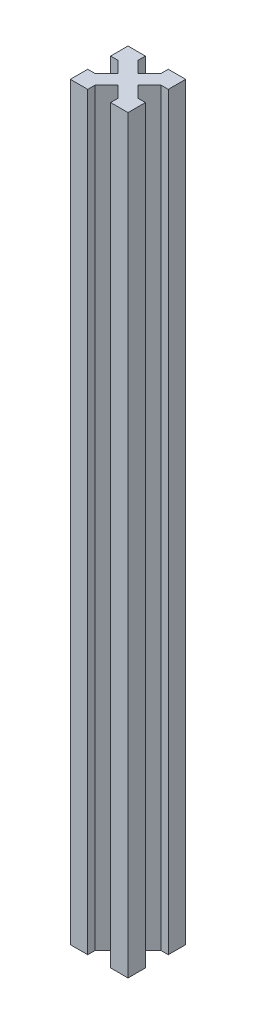
ISO-10303-21;
HEADER;
FILE_DESCRIPTION(('STEP AP214'),'2;1');
FILE_NAME('part.step','',(''),(''),'','','');
FILE_SCHEMA(('AUTOMOTIVE_DESIGN { 1 0 10303 214 1 1 1 1 }'));
ENDSEC;
DATA;
#1=APPLICATION_CONTEXT('core data for automotive mechanical design processes');
#2=APPLICATION_PROTOCOL_DEFINITION('international standard','automotive_design',2000,#1);
#3=PRODUCT_CONTEXT('',#1,'mechanical');
#4=PRODUCT('Part','Part','',(#3));
#5=PRODUCT_RELATED_PRODUCT_CATEGORY('part','',(#4));
#6=PRODUCT_DEFINITION_FORMATION('','',#4);
#7=PRODUCT_DEFINITION_CONTEXT('part definition',#1,'design');
#8=PRODUCT_DEFINITION('design','',#6,#7);
#9=PRODUCT_DEFINITION_SHAPE('','',#8);
#10=(LENGTH_UNIT() NAMED_UNIT(*) SI_UNIT(.MILLI.,.METRE.));
#11=(NAMED_UNIT(*) PLANE_ANGLE_UNIT() SI_UNIT($,.RADIAN.));
#12=(NAMED_UNIT(*) SI_UNIT($,.STERADIAN.) SOLID_ANGLE_UNIT());
#13=UNCERTAINTY_MEASURE_WITH_UNIT(LENGTH_MEASURE(1.E-05),#10,'distance_accuracy_value','');
#14=(GEOMETRIC_REPRESENTATION_CONTEXT(3) GLOBAL_UNCERTAINTY_ASSIGNED_CONTEXT((#13)) GLOBAL_UNIT_ASSIGNED_CONTEXT((#10,
#11,#12)) REPRESENTATION_CONTEXT('',''));
#15=CARTESIAN_POINT('',(0.,0.,0.));
#16=DIRECTION('',(0.,0.,1.));
#17=DIRECTION('',(1.,0.,0.));
#18=AXIS2_PLACEMENT_3D('',#15,#16,#17);
#19=CARTESIAN_POINT('',(-11.7677669529664,260.,-11.7677669529664));
#20=DIRECTION('',(0.707106781186548,0.,0.707106781186547));
#21=DIRECTION('',(0.707106781186547,0.,-0.707106781186548));
#22=AXIS2_PLACEMENT_3D('',#19,#20,#21);
#23=PLANE('',#22);
#24=DIRECTION('',(-0.707106781186547,0.,0.707106781186548));
#25=VECTOR('',#24,1.);
#26=CARTESIAN_POINT('',(-11.7677669529664,0.,-11.7677669529664));
#27=LINE('',#26,#25);
#28=CARTESIAN_POINT('',(-13.5355339059327,0.,-10.));
#29=VERTEX_POINT('',#28);
#30=CARTESIAN_POINT('',(-17.5,0.,-6.03553390593274));
#31=VERTEX_POINT('',#30);
#32=EDGE_CURVE('E231',#29,#31,#27,.T.);
#33=ORIENTED_EDGE('',*,*,#32,.T.);
#34=DIRECTION('',(0.,-1.,0.));
#35=VECTOR('',#34,1.);
#36=CARTESIAN_POINT('',(-17.5,260.,-6.03553390593274));
#37=LINE('',#36,#35);
#38=CARTESIAN_POINT('',(-17.5,260.,-6.03553390593274));
#39=VERTEX_POINT('',#38);
#40=EDGE_CURVE('E11',#39,#31,#37,.T.);
#41=ORIENTED_EDGE('',*,*,#40,.F.);
#42=DIRECTION('',(-0.707106781186547,0.,0.707106781186548));
#43=VECTOR('',#42,1.);
#44=CARTESIAN_POINT('',(-11.7677669529664,260.,-11.7677669529664));
#45=LINE('',#44,#43);
#46=CARTESIAN_POINT('',(-13.5355339059327,260.,-10.));
#47=VERTEX_POINT('',#46);
#48=EDGE_CURVE('E294',#47,#39,#45,.T.);
#49=ORIENTED_EDGE('',*,*,#48,.F.);
#50=DIRECTION('',(0.,-1.,0.));
#51=VECTOR('',#50,1.);
#52=CARTESIAN_POINT('',(-13.5355339059327,260.,-10.));
#53=LINE('',#52,#51);
#54=EDGE_CURVE('E227',#47,#29,#53,.T.);
#55=ORIENTED_EDGE('',*,*,#54,.T.);
#56=EDGE_LOOP('',(#33,#41,#49,#55));
#57=FACE_BOUND('',#56,.T.);
#58=ADVANCED_FACE('F41',(#57),#23,.F.);
#59=CARTESIAN_POINT('',(0.,260.,-6.03553390593274));
#60=DIRECTION('',(0.,0.,1.));
#61=DIRECTION('',(1.,0.,0.));
#62=AXIS2_PLACEMENT_3D('',#59,#60,#61);
#63=PLANE('',#62);
#64=DIRECTION('',(-1.,0.,0.));
#65=VECTOR('',#64,1.);
#66=CARTESIAN_POINT('',(0.,0.,-6.03553390593274));
#67=LINE('',#66,#65);
#68=CARTESIAN_POINT('',(-20.,0.,-6.03553390593274));
#69=VERTEX_POINT('',#68);
#70=EDGE_CURVE('E234',#31,#69,#67,.T.);
#71=ORIENTED_EDGE('',*,*,#70,.T.);
#72=DIRECTION('',(0.,-1.,0.));
#73=VECTOR('',#72,1.);
#74=CARTESIAN_POINT('',(-20.,260.,-6.03553390593274));
#75=LINE('',#74,#73);
#76=CARTESIAN_POINT('',(-20.,260.,-6.03553390593274));
#77=VERTEX_POINT('',#76);
#78=EDGE_CURVE('E49',#77,#69,#75,.T.);
#79=ORIENTED_EDGE('',*,*,#78,.F.);
#80=DIRECTION('',(-1.,0.,0.));
#81=VECTOR('',#80,1.);
#82=CARTESIAN_POINT('',(0.,260.,-6.03553390593274));
#83=LINE('',#82,#81);
#84=EDGE_CURVE('E144',#39,#77,#83,.T.);
#85=ORIENTED_EDGE('',*,*,#84,.F.);
#86=ORIENTED_EDGE('',*,*,#40,.T.);
#87=EDGE_LOOP('',(#71,#79,#85,#86));
#88=FACE_BOUND('',#87,.T.);
#89=ADVANCED_FACE('F343',(#88),#63,.F.);
#90=CARTESIAN_POINT('',(-20.,260.,0.));
#91=DIRECTION('',(-1.,0.,0.));
#92=DIRECTION('',(0.,0.,1.));
#93=AXIS2_PLACEMENT_3D('',#90,#91,#92);
#94=PLANE('',#93);
#95=DIRECTION('',(0.,0.,-1.));
#96=VECTOR('',#95,1.);
#97=CARTESIAN_POINT('',(-20.,0.,0.));
#98=LINE('',#97,#96);
#99=CARTESIAN_POINT('',(-20.,0.,0.));
#100=VERTEX_POINT('',#99);
#101=EDGE_CURVE('E237',#100,#69,#98,.T.);
#102=ORIENTED_EDGE('',*,*,#101,.F.);
#103=DIRECTION('',(0.,-1.,0.));
#104=VECTOR('',#103,1.);
#105=CARTESIAN_POINT('',(-20.,260.,0.));
#106=LINE('',#105,#104);
#107=CARTESIAN_POINT('',(-20.,260.,0.));
#108=VERTEX_POINT('',#107);
#109=EDGE_CURVE('E336',#108,#100,#106,.T.);
#110=ORIENTED_EDGE('',*,*,#109,.F.);
#111=DIRECTION('',(0.,0.,-1.));
#112=VECTOR('',#111,1.);
#113=CARTESIAN_POINT('',(-20.,260.,0.));
#114=LINE('',#113,#112);
#115=EDGE_CURVE('E342',#108,#77,#114,.T.);
#116=ORIENTED_EDGE('',*,*,#115,.T.);
#117=ORIENTED_EDGE('',*,*,#78,.T.);
#118=EDGE_LOOP('',(#102,#110,#116,#117));
#119=FACE_BOUND('',#118,.T.);
#120=ADVANCED_FACE('F340',(#119),#94,.T.);
#121=CARTESIAN_POINT('',(0.,260.,0.));
#122=DIRECTION('',(0.,0.,1.));
#123=DIRECTION('',(1.,0.,0.));
#124=AXIS2_PLACEMENT_3D('',#121,#122,#123);
#125=PLANE('',#124);
#126=DIRECTION('',(-1.,0.,0.));
#127=VECTOR('',#126,1.);
#128=CARTESIAN_POINT('',(0.,0.,0.));
#129=LINE('',#128,#127);
#130=CARTESIAN_POINT('',(-13.9644660940673,0.,0.));
#131=VERTEX_POINT('',#130);
#132=EDGE_CURVE('E240',#131,#100,#129,.T.);
#133=ORIENTED_EDGE('',*,*,#132,.F.);
#134=DIRECTION('',(0.,-1.,0.));
#135=VECTOR('',#134,1.);
#136=CARTESIAN_POINT('',(-13.9644660940673,260.,0.));
#137=LINE('',#136,#135);
#138=CARTESIAN_POINT('',(-13.9644660940673,260.,0.));
#139=VERTEX_POINT('',#138);
#140=EDGE_CURVE('E334',#139,#131,#137,.T.);
#141=ORIENTED_EDGE('',*,*,#140,.F.);
#142=DIRECTION('',(-1.,0.,0.));
#143=VECTOR('',#142,1.);
#144=CARTESIAN_POINT('',(0.,260.,0.));
#145=LINE('',#144,#143);
#146=EDGE_CURVE('E354',#139,#108,#145,.T.);
#147=ORIENTED_EDGE('',*,*,#146,.T.);
#148=ORIENTED_EDGE('',*,*,#109,.T.);
#149=EDGE_LOOP('',(#133,#141,#147,#148));
#150=FACE_BOUND('',#149,.T.);
#151=ADVANCED_FACE('F351',(#150),#125,.T.);
#152=CARTESIAN_POINT('',(-13.9644660940673,260.,0.));
#153=DIRECTION('',(1.,0.,0.));
#154=DIRECTION('',(0.,0.,-1.));
#155=AXIS2_PLACEMENT_3D('',#152,#153,#154);
#156=PLANE('',#155);
#157=DIRECTION('',(0.,0.,1.));
#158=VECTOR('',#157,1.);
#159=CARTESIAN_POINT('',(-13.9644660940673,0.,0.));
#160=LINE('',#159,#158);
#161=CARTESIAN_POINT('',(-13.9644660940673,0.,-2.5));
#162=VERTEX_POINT('',#161);
#163=EDGE_CURVE('E243',#162,#131,#160,.T.);
#164=ORIENTED_EDGE('',*,*,#163,.F.);
#165=DIRECTION('',(0.,-1.,0.));
#166=VECTOR('',#165,1.);
#167=CARTESIAN_POINT('',(-13.9644660940673,260.,-2.5));
#168=LINE('',#167,#166);
#169=CARTESIAN_POINT('',(-13.9644660940673,260.,-2.5));
#170=VERTEX_POINT('',#169);
#171=EDGE_CURVE('E332',#170,#162,#168,.T.);
#172=ORIENTED_EDGE('',*,*,#171,.F.);
#173=DIRECTION('',(0.,0.,1.));
#174=VECTOR('',#173,1.);
#175=CARTESIAN_POINT('',(-13.9644660940673,260.,0.));
#176=LINE('',#175,#174);
#177=EDGE_CURVE('E358',#170,#139,#176,.T.);
#178=ORIENTED_EDGE('',*,*,#177,.T.);
#179=ORIENTED_EDGE('',*,*,#140,.T.);
#180=EDGE_LOOP('',(#164,#172,#178,#179));
#181=FACE_BOUND('',#180,.T.);
#182=ADVANCED_FACE('F432',(#181),#156,.T.);
#183=CARTESIAN_POINT('',(-8.23223304703363,260.,-8.23223304703363));
#184=DIRECTION('',(0.707106781186548,0.,0.707106781186547));
#185=DIRECTION('',(0.707106781186547,0.,-0.707106781186548));
#186=AXIS2_PLACEMENT_3D('',#183,#184,#185);
#187=PLANE('',#186);
#188=DIRECTION('',(-0.707106781186547,0.,0.707106781186548));
#189=VECTOR('',#188,1.);
#190=CARTESIAN_POINT('',(-8.23223304703363,0.,-8.23223304703363));
#191=LINE('',#190,#189);
#192=CARTESIAN_POINT('',(-10.,0.,-6.46446609406726));
#193=VERTEX_POINT('',#192);
#194=EDGE_CURVE('E246',#193,#162,#191,.T.);
#195=ORIENTED_EDGE('',*,*,#194,.F.);
#196=DIRECTION('',(0.,-1.,0.));
#197=VECTOR('',#196,1.);
#198=CARTESIAN_POINT('',(-10.,260.,-6.46446609406726));
#199=LINE('',#198,#197);
#200=CARTESIAN_POINT('',(-10.,260.,-6.46446609406726));
#201=VERTEX_POINT('',#200);
#202=EDGE_CURVE('E330',#201,#193,#199,.T.);
#203=ORIENTED_EDGE('',*,*,#202,.F.);
#204=DIRECTION('',(-0.707106781186547,0.,0.707106781186548));
#205=VECTOR('',#204,1.);
#206=CARTESIAN_POINT('',(-8.23223304703363,260.,-8.23223304703363));
#207=LINE('',#206,#205);
#208=EDGE_CURVE('E364',#201,#170,#207,.T.);
#209=ORIENTED_EDGE('',*,*,#208,.T.);
#210=ORIENTED_EDGE('',*,*,#171,.T.);
#211=EDGE_LOOP('',(#195,#203,#209,#210));
#212=FACE_BOUND('',#211,.T.);
#213=ADVANCED_FACE('F435',(#212),#187,.T.);
#214=CARTESIAN_POINT('',(-1.76776695296637,260.,1.76776695296637));
#215=DIRECTION('',(0.707106781186548,0.,-0.707106781186548));
#216=DIRECTION('',(-0.707106781186548,0.,-0.707106781186548));
#217=AXIS2_PLACEMENT_3D('',#214,#215,#216);
#218=PLANE('',#217);
#219=DIRECTION('',(0.707106781186548,0.,0.707106781186548));
#220=VECTOR('',#219,1.);
#221=CARTESIAN_POINT('',(-1.76776695296637,0.,1.76776695296637));
#222=LINE('',#221,#220);
#223=CARTESIAN_POINT('',(-6.03553390593274,0.,-2.5));
#224=VERTEX_POINT('',#223);
#225=EDGE_CURVE('E249',#193,#224,#222,.T.);
#226=ORIENTED_EDGE('',*,*,#225,.T.);
#227=DIRECTION('',(0.,-1.,0.));
#228=VECTOR('',#227,1.);
#229=CARTESIAN_POINT('',(-6.03553390593274,260.,-2.5));
#230=LINE('',#229,#228);
#231=CARTESIAN_POINT('',(-6.03553390593274,260.,-2.5));
#232=VERTEX_POINT('',#231);
#233=EDGE_CURVE('E327',#232,#224,#230,.T.);
#234=ORIENTED_EDGE('',*,*,#233,.F.);
#235=DIRECTION('',(0.707106781186548,0.,0.707106781186548));
#236=VECTOR('',#235,1.);
#237=CARTESIAN_POINT('',(-1.76776695296637,260.,1.76776695296637));
#238=LINE('',#237,#236);
#239=EDGE_CURVE('E367',#201,#232,#238,.T.);
#240=ORIENTED_EDGE('',*,*,#239,.F.);
#241=ORIENTED_EDGE('',*,*,#202,.T.);
#242=EDGE_LOOP('',(#226,#234,#240,#241));
#243=FACE_BOUND('',#242,.T.);
#244=ADVANCED_FACE('F439',(#243),#218,.F.);
#245=CARTESIAN_POINT('',(-6.03553390593274,260.,0.));
#246=DIRECTION('',(1.,0.,0.));
#247=DIRECTION('',(0.,0.,-1.));
#248=AXIS2_PLACEMENT_3D('',#245,#246,#247);
#249=PLANE('',#248);
#250=DIRECTION('',(0.,0.,1.));
#251=VECTOR('',#250,1.);
#252=CARTESIAN_POINT('',(-6.03553390593274,0.,0.));
#253=LINE('',#252,#251);
#254=CARTESIAN_POINT('',(-6.03553390593274,0.,0.));
#255=VERTEX_POINT('',#254);
#256=EDGE_CURVE('E251',#224,#255,#253,.T.);
#257=ORIENTED_EDGE('',*,*,#256,.T.);
#258=DIRECTION('',(0.,-1.,0.));
#259=VECTOR('',#258,1.);
#260=CARTESIAN_POINT('',(-6.03553390593274,260.,0.));
#261=LINE('',#260,#259);
#262=CARTESIAN_POINT('',(-6.03553390593274,260.,0.));
#263=VERTEX_POINT('',#262);
#264=EDGE_CURVE('E325',#263,#255,#261,.T.);
#265=ORIENTED_EDGE('',*,*,#264,.F.);
#266=DIRECTION('',(0.,0.,1.));
#267=VECTOR('',#266,1.);
#268=CARTESIAN_POINT('',(-6.03553390593274,260.,0.));
#269=LINE('',#268,#267);
#270=EDGE_CURVE('E369',#232,#263,#269,.T.);
#271=ORIENTED_EDGE('',*,*,#270,.F.);
#272=ORIENTED_EDGE('',*,*,#233,.T.);
#273=EDGE_LOOP('',(#257,#265,#271,#272));
#274=FACE_BOUND('',#273,.T.);
#275=ADVANCED_FACE('F443',(#274),#249,.F.);
#276=CARTESIAN_POINT('',(0.,260.,0.));
#277=DIRECTION('',(0.,0.,1.));
#278=DIRECTION('',(1.,0.,0.));
#279=AXIS2_PLACEMENT_3D('',#276,#277,#278);
#280=PLANE('',#279);
#281=DIRECTION('',(-1.,0.,0.));
#282=VECTOR('',#281,1.);
#283=CARTESIAN_POINT('',(0.,0.,0.));
#284=LINE('',#283,#282);
#285=CARTESIAN_POINT('',(0.,0.,0.));
#286=VERTEX_POINT('',#285);
#287=EDGE_CURVE('E254',#286,#255,#284,.T.);
#288=ORIENTED_EDGE('',*,*,#287,.F.);
#289=DIRECTION('',(0.,-1.,0.));
#290=VECTOR('',#289,1.);
#291=CARTESIAN_POINT('',(0.,260.,0.));
#292=LINE('',#291,#290);
#293=CARTESIAN_POINT('',(0.,260.,0.));
#294=VERTEX_POINT('',#293);
#295=EDGE_CURVE('E323',#294,#286,#292,.T.);
#296=ORIENTED_EDGE('',*,*,#295,.F.);
#297=DIRECTION('',(-1.,0.,0.));
#298=VECTOR('',#297,1.);
#299=CARTESIAN_POINT('',(0.,260.,0.));
#300=LINE('',#299,#298);
#301=EDGE_CURVE('E371',#294,#263,#300,.T.);
#302=ORIENTED_EDGE('',*,*,#301,.T.);
#303=ORIENTED_EDGE('',*,*,#264,.T.);
#304=EDGE_LOOP('',(#288,#296,#302,#303));
#305=FACE_BOUND('',#304,.T.);
#306=ADVANCED_FACE('F447',(#305),#280,.T.);
#307=CARTESIAN_POINT('',(0.,260.,0.));
#308=DIRECTION('',(-1.,0.,0.));
#309=DIRECTION('',(0.,0.,1.));
#310=AXIS2_PLACEMENT_3D('',#307,#308,#309);
#311=PLANE('',#310);
#312=DIRECTION('',(0.,0.,-1.));
#313=VECTOR('',#312,1.);
#314=CARTESIAN_POINT('',(0.,0.,0.));
#315=LINE('',#314,#313);
#316=CARTESIAN_POINT('',(0.,0.,-6.03553390593274));
#317=VERTEX_POINT('',#316);
#318=EDGE_CURVE('E257',#286,#317,#315,.T.);
#319=ORIENTED_EDGE('',*,*,#318,.T.);
#320=DIRECTION('',(0.,-1.,0.));
#321=VECTOR('',#320,1.);
#322=CARTESIAN_POINT('',(0.,260.,-6.03553390593274));
#323=LINE('',#322,#321);
#324=CARTESIAN_POINT('',(0.,260.,-6.03553390593274));
#325=VERTEX_POINT('',#324);
#326=EDGE_CURVE('E321',#325,#317,#323,.T.);
#327=ORIENTED_EDGE('',*,*,#326,.F.);
#328=DIRECTION('',(0.,0.,-1.));
#329=VECTOR('',#328,1.);
#330=CARTESIAN_POINT('',(0.,260.,0.));
#331=LINE('',#330,#329);
#332=EDGE_CURVE('E374',#294,#325,#331,.T.);
#333=ORIENTED_EDGE('',*,*,#332,.F.);
#334=ORIENTED_EDGE('',*,*,#295,.T.);
#335=EDGE_LOOP('',(#319,#327,#333,#334));
#336=FACE_BOUND('',#335,.T.);
#337=ADVANCED_FACE('F451',(#336),#311,.F.);
#338=CARTESIAN_POINT('',(0.,260.,-6.03553390593275));
#339=DIRECTION('',(0.,0.,-1.));
#340=DIRECTION('',(-1.,0.,0.));
#341=AXIS2_PLACEMENT_3D('',#338,#339,#340);
#342=PLANE('',#341);
#343=DIRECTION('',(1.,0.,0.));
#344=VECTOR('',#343,1.);
#345=CARTESIAN_POINT('',(0.,0.,-6.03553390593275));
#346=LINE('',#345,#344);
#347=CARTESIAN_POINT('',(-2.5,0.,-6.03553390593275));
#348=VERTEX_POINT('',#347);
#349=EDGE_CURVE('E260',#348,#317,#346,.T.);
#350=ORIENTED_EDGE('',*,*,#349,.F.);
#351=DIRECTION('',(0.,-1.,0.));
#352=VECTOR('',#351,1.);
#353=CARTESIAN_POINT('',(-2.5,260.,-6.03553390593275));
#354=LINE('',#353,#352);
#355=CARTESIAN_POINT('',(-2.5,260.,-6.03553390593275));
#356=VERTEX_POINT('',#355);
#357=EDGE_CURVE('E319',#356,#348,#354,.T.);
#358=ORIENTED_EDGE('',*,*,#357,.F.);
#359=DIRECTION('',(1.,0.,0.));
#360=VECTOR('',#359,1.);
#361=CARTESIAN_POINT('',(0.,260.,-6.03553390593275));
#362=LINE('',#361,#360);
#363=EDGE_CURVE('E376',#356,#325,#362,.T.);
#364=ORIENTED_EDGE('',*,*,#363,.T.);
#365=ORIENTED_EDGE('',*,*,#326,.T.);
#366=EDGE_LOOP('',(#350,#358,#364,#365));
#367=FACE_BOUND('',#366,.T.);
#368=ADVANCED_FACE('F455',(#367),#342,.T.);
#369=CARTESIAN_POINT('',(1.76776695296637,260.,-1.76776695296638));
#370=DIRECTION('',(0.707106781186547,0.,-0.707106781186548));
#371=DIRECTION('',(-0.707106781186548,0.,-0.707106781186547));
#372=AXIS2_PLACEMENT_3D('',#369,#370,#371);
#373=PLANE('',#372);
#374=DIRECTION('',(0.707106781186548,0.,0.707106781186547));
#375=VECTOR('',#374,1.);
#376=CARTESIAN_POINT('',(1.76776695296637,0.,-1.76776695296638));
#377=LINE('',#376,#375);
#378=CARTESIAN_POINT('',(-6.46446609406726,0.,-10.));
#379=VERTEX_POINT('',#378);
#380=EDGE_CURVE('E263',#379,#348,#377,.T.);
#381=ORIENTED_EDGE('',*,*,#380,.F.);
#382=DIRECTION('',(0.,-1.,0.));
#383=VECTOR('',#382,1.);
#384=CARTESIAN_POINT('',(-6.46446609406726,260.,-10.));
#385=LINE('',#384,#383);
#386=CARTESIAN_POINT('',(-6.46446609406726,260.,-10.));
#387=VERTEX_POINT('',#386);
#388=EDGE_CURVE('E317',#387,#379,#385,.T.);
#389=ORIENTED_EDGE('',*,*,#388,.F.);
#390=DIRECTION('',(0.707106781186548,0.,0.707106781186547));
#391=VECTOR('',#390,1.);
#392=CARTESIAN_POINT('',(1.76776695296637,260.,-1.76776695296638));
#393=LINE('',#392,#391);
#394=EDGE_CURVE('E379',#387,#356,#393,.T.);
#395=ORIENTED_EDGE('',*,*,#394,.T.);
#396=ORIENTED_EDGE('',*,*,#357,.T.);
#397=EDGE_LOOP('',(#381,#389,#395,#396));
#398=FACE_BOUND('',#397,.T.);
#399=ADVANCED_FACE('F459',(#398),#373,.T.);
#400=CARTESIAN_POINT('',(-8.23223304703363,260.,-8.23223304703363));
#401=DIRECTION('',(0.707106781186548,0.,0.707106781186547));
#402=DIRECTION('',(0.707106781186547,0.,-0.707106781186548));
#403=AXIS2_PLACEMENT_3D('',#400,#401,#402);
#404=PLANE('',#403);
#405=DIRECTION('',(-0.707106781186547,0.,0.707106781186548));
#406=VECTOR('',#405,1.);
#407=CARTESIAN_POINT('',(-8.23223304703363,0.,-8.23223304703363));
#408=LINE('',#407,#406);
#409=CARTESIAN_POINT('',(-2.5,0.,-13.9644660940673));
#410=VERTEX_POINT('',#409);
#411=EDGE_CURVE('E266',#410,#379,#408,.T.);
#412=ORIENTED_EDGE('',*,*,#411,.F.);
#413=DIRECTION('',(0.,-1.,0.));
#414=VECTOR('',#413,1.);
#415=CARTESIAN_POINT('',(-2.5,260.,-13.9644660940673));
#416=LINE('',#415,#414);
#417=CARTESIAN_POINT('',(-2.5,260.,-13.9644660940673));
#418=VERTEX_POINT('',#417);
#419=EDGE_CURVE('E315',#418,#410,#416,.T.);
#420=ORIENTED_EDGE('',*,*,#419,.F.);
#421=DIRECTION('',(-0.707106781186547,0.,0.707106781186548));
#422=VECTOR('',#421,1.);
#423=CARTESIAN_POINT('',(-8.23223304703363,260.,-8.23223304703363));
#424=LINE('',#423,#422);
#425=EDGE_CURVE('E382',#418,#387,#424,.T.);
#426=ORIENTED_EDGE('',*,*,#425,.T.);
#427=ORIENTED_EDGE('',*,*,#388,.T.);
#428=EDGE_LOOP('',(#412,#420,#426,#427));
#429=FACE_BOUND('',#428,.T.);
#430=ADVANCED_FACE('F463',(#429),#404,.T.);
#431=CARTESIAN_POINT('',(0.,260.,-13.9644660940673));
#432=DIRECTION('',(0.,0.,-1.));
#433=DIRECTION('',(-1.,0.,0.));
#434=AXIS2_PLACEMENT_3D('',#431,#432,#433);
#435=PLANE('',#434);
#436=DIRECTION('',(1.,0.,0.));
#437=VECTOR('',#436,1.);
#438=CARTESIAN_POINT('',(0.,0.,-13.9644660940673));
#439=LINE('',#438,#437);
#440=CARTESIAN_POINT('',(0.,0.,-13.9644660940673));
#441=VERTEX_POINT('',#440);
#442=EDGE_CURVE('E269',#410,#441,#439,.T.);
#443=ORIENTED_EDGE('',*,*,#442,.T.);
#444=DIRECTION('',(0.,-1.,0.));
#445=VECTOR('',#444,1.);
#446=CARTESIAN_POINT('',(0.,260.,-13.9644660940673));
#447=LINE('',#446,#445);
#448=CARTESIAN_POINT('',(0.,260.,-13.9644660940673));
#449=VERTEX_POINT('',#448);
#450=EDGE_CURVE('E312',#449,#441,#447,.T.);
#451=ORIENTED_EDGE('',*,*,#450,.F.);
#452=DIRECTION('',(1.,0.,0.));
#453=VECTOR('',#452,1.);
#454=CARTESIAN_POINT('',(0.,260.,-13.9644660940673));
#455=LINE('',#454,#453);
#456=EDGE_CURVE('E385',#418,#449,#455,.T.);
#457=ORIENTED_EDGE('',*,*,#456,.F.);
#458=ORIENTED_EDGE('',*,*,#419,.T.);
#459=EDGE_LOOP('',(#443,#451,#457,#458));
#460=FACE_BOUND('',#459,.T.);
#461=ADVANCED_FACE('F467',(#460),#435,.F.);
#462=CARTESIAN_POINT('',(0.,260.,0.));
#463=DIRECTION('',(-1.,0.,0.));
#464=DIRECTION('',(0.,0.,1.));
#465=AXIS2_PLACEMENT_3D('',#462,#463,#464);
#466=PLANE('',#465);
#467=DIRECTION('',(0.,0.,-1.));
#468=VECTOR('',#467,1.);
#469=CARTESIAN_POINT('',(0.,0.,0.));
#470=LINE('',#469,#468);
#471=CARTESIAN_POINT('',(0.,0.,-20.));
#472=VERTEX_POINT('',#471);
#473=EDGE_CURVE('E271',#441,#472,#470,.T.);
#474=ORIENTED_EDGE('',*,*,#473,.T.);
#475=DIRECTION('',(0.,-1.,0.));
#476=VECTOR('',#475,1.);
#477=CARTESIAN_POINT('',(0.,260.,-20.));
#478=LINE('',#477,#476);
#479=CARTESIAN_POINT('',(0.,260.,-20.));
#480=VERTEX_POINT('',#479);
#481=EDGE_CURVE('E309',#480,#472,#478,.T.);
#482=ORIENTED_EDGE('',*,*,#481,.F.);
#483=DIRECTION('',(0.,0.,-1.));
#484=VECTOR('',#483,1.);
#485=CARTESIAN_POINT('',(0.,260.,0.));
#486=LINE('',#485,#484);
#487=EDGE_CURVE('E387',#449,#480,#486,.T.);
#488=ORIENTED_EDGE('',*,*,#487,.F.);
#489=ORIENTED_EDGE('',*,*,#450,.T.);
#490=EDGE_LOOP('',(#474,#482,#488,#489));
#491=FACE_BOUND('',#490,.T.);
#492=ADVANCED_FACE('F471',(#491),#466,.F.);
#493=CARTESIAN_POINT('',(0.,260.,-20.));
#494=DIRECTION('',(0.,0.,1.));
#495=DIRECTION('',(1.,0.,0.));
#496=AXIS2_PLACEMENT_3D('',#493,#494,#495);
#497=PLANE('',#496);
#498=DIRECTION('',(-1.,0.,0.));
#499=VECTOR('',#498,1.);
#500=CARTESIAN_POINT('',(0.,0.,-20.));
#501=LINE('',#500,#499);
#502=CARTESIAN_POINT('',(-6.03553390593274,0.,-20.));
#503=VERTEX_POINT('',#502);
#504=EDGE_CURVE('E273',#472,#503,#501,.T.);
#505=ORIENTED_EDGE('',*,*,#504,.T.);
#506=DIRECTION('',(0.,-1.,0.));
#507=VECTOR('',#506,1.);
#508=CARTESIAN_POINT('',(-6.03553390593274,260.,-20.));
#509=LINE('',#508,#507);
#510=CARTESIAN_POINT('',(-6.03553390593274,260.,-20.));
#511=VERTEX_POINT('',#510);
#512=EDGE_CURVE('E307',#511,#503,#509,.T.);
#513=ORIENTED_EDGE('',*,*,#512,.F.);
#514=DIRECTION('',(-1.,0.,0.));
#515=VECTOR('',#514,1.);
#516=CARTESIAN_POINT('',(0.,260.,-20.));
#517=LINE('',#516,#515);
#518=EDGE_CURVE('E389',#480,#511,#517,.T.);
#519=ORIENTED_EDGE('',*,*,#518,.F.);
#520=ORIENTED_EDGE('',*,*,#481,.T.);
#521=EDGE_LOOP('',(#505,#513,#519,#520));
#522=FACE_BOUND('',#521,.T.);
#523=ADVANCED_FACE('F475',(#522),#497,.F.);
#524=CARTESIAN_POINT('',(-6.03553390593275,260.,0.));
#525=DIRECTION('',(-1.,0.,0.));
#526=DIRECTION('',(0.,0.,1.));
#527=AXIS2_PLACEMENT_3D('',#524,#525,#526);
#528=PLANE('',#527);
#529=DIRECTION('',(0.,0.,-1.));
#530=VECTOR('',#529,1.);
#531=CARTESIAN_POINT('',(-6.03553390593275,0.,0.));
#532=LINE('',#531,#530);
#533=CARTESIAN_POINT('',(-6.03553390593274,0.,-17.5));
#534=VERTEX_POINT('',#533);
#535=EDGE_CURVE('E276',#534,#503,#532,.T.);
#536=ORIENTED_EDGE('',*,*,#535,.F.);
#537=DIRECTION('',(0.,-1.,0.));
#538=VECTOR('',#537,1.);
#539=CARTESIAN_POINT('',(-6.03553390593274,260.,-17.5));
#540=LINE('',#539,#538);
#541=CARTESIAN_POINT('',(-6.03553390593274,260.,-17.5));
#542=VERTEX_POINT('',#541);
#543=EDGE_CURVE('E305',#542,#534,#540,.T.);
#544=ORIENTED_EDGE('',*,*,#543,.F.);
#545=DIRECTION('',(0.,0.,-1.));
#546=VECTOR('',#545,1.);
#547=CARTESIAN_POINT('',(-6.03553390593275,260.,0.));
#548=LINE('',#547,#546);
#549=EDGE_CURVE('E391',#542,#511,#548,.T.);
#550=ORIENTED_EDGE('',*,*,#549,.T.);
#551=ORIENTED_EDGE('',*,*,#512,.T.);
#552=EDGE_LOOP('',(#536,#544,#550,#551));
#553=FACE_BOUND('',#552,.T.);
#554=ADVANCED_FACE('F479',(#553),#528,.T.);
#555=CARTESIAN_POINT('',(-11.7677669529664,260.,-11.7677669529664));
#556=DIRECTION('',(0.707106781186548,0.,0.707106781186547));
#557=DIRECTION('',(0.707106781186547,0.,-0.707106781186548));
#558=AXIS2_PLACEMENT_3D('',#555,#556,#557);
#559=PLANE('',#558);
#560=DIRECTION('',(-0.707106781186547,0.,0.707106781186548));
#561=VECTOR('',#560,1.);
#562=CARTESIAN_POINT('',(-11.7677669529664,0.,-11.7677669529664));
#563=LINE('',#562,#561);
#564=CARTESIAN_POINT('',(-10.,0.,-13.5355339059327));
#565=VERTEX_POINT('',#564);
#566=EDGE_CURVE('E279',#534,#565,#563,.T.);
#567=ORIENTED_EDGE('',*,*,#566,.T.);
#568=DIRECTION('',(0.,-1.,0.));
#569=VECTOR('',#568,1.);
#570=CARTESIAN_POINT('',(-10.,260.,-13.5355339059327));
#571=LINE('',#570,#569);
#572=CARTESIAN_POINT('',(-10.,260.,-13.5355339059327));
#573=VERTEX_POINT('',#572);
#574=EDGE_CURVE('E303',#573,#565,#571,.T.);
#575=ORIENTED_EDGE('',*,*,#574,.F.);
#576=DIRECTION('',(-0.707106781186547,0.,0.707106781186548));
#577=VECTOR('',#576,1.);
#578=CARTESIAN_POINT('',(-11.7677669529664,260.,-11.7677669529664));
#579=LINE('',#578,#577);
#580=EDGE_CURVE('E394',#542,#573,#579,.T.);
#581=ORIENTED_EDGE('',*,*,#580,.F.);
#582=ORIENTED_EDGE('',*,*,#543,.T.);
#583=EDGE_LOOP('',(#567,#575,#581,#582));
#584=FACE_BOUND('',#583,.T.);
#585=ADVANCED_FACE('F483',(#584),#559,.F.);
#586=CARTESIAN_POINT('',(1.76776695296637,260.,-1.76776695296638));
#587=DIRECTION('',(0.707106781186547,0.,-0.707106781186548));
#588=DIRECTION('',(-0.707106781186548,0.,-0.707106781186547));
#589=AXIS2_PLACEMENT_3D('',#586,#587,#588);
#590=PLANE('',#589);
#591=DIRECTION('',(0.707106781186548,0.,0.707106781186547));
#592=VECTOR('',#591,1.);
#593=CARTESIAN_POINT('',(1.76776695296637,0.,-1.76776695296638));
#594=LINE('',#593,#592);
#595=CARTESIAN_POINT('',(-13.9644660940673,0.,-17.5));
#596=VERTEX_POINT('',#595);
#597=EDGE_CURVE('E282',#596,#565,#594,.T.);
#598=ORIENTED_EDGE('',*,*,#597,.F.);
#599=DIRECTION('',(0.,-1.,0.));
#600=VECTOR('',#599,1.);
#601=CARTESIAN_POINT('',(-13.9644660940673,260.,-17.5));
#602=LINE('',#601,#600);
#603=CARTESIAN_POINT('',(-13.9644660940673,260.,-17.5));
#604=VERTEX_POINT('',#603);
#605=EDGE_CURVE('E301',#604,#596,#602,.T.);
#606=ORIENTED_EDGE('',*,*,#605,.F.);
#607=DIRECTION('',(0.707106781186548,0.,0.707106781186547));
#608=VECTOR('',#607,1.);
#609=CARTESIAN_POINT('',(1.76776695296637,260.,-1.76776695296638));
#610=LINE('',#609,#608);
#611=EDGE_CURVE('E396',#604,#573,#610,.T.);
#612=ORIENTED_EDGE('',*,*,#611,.T.);
#613=ORIENTED_EDGE('',*,*,#574,.T.);
#614=EDGE_LOOP('',(#598,#606,#612,#613));
#615=FACE_BOUND('',#614,.T.);
#616=ADVANCED_FACE('F487',(#615),#590,.T.);
#617=CARTESIAN_POINT('',(-13.9644660940672,260.,0.));
#618=DIRECTION('',(-1.,0.,0.));
#619=DIRECTION('',(0.,0.,1.));
#620=AXIS2_PLACEMENT_3D('',#617,#618,#619);
#621=PLANE('',#620);
#622=DIRECTION('',(0.,0.,-1.));
#623=VECTOR('',#622,1.);
#624=CARTESIAN_POINT('',(-13.9644660940672,0.,0.));
#625=LINE('',#624,#623);
#626=CARTESIAN_POINT('',(-13.9644660940673,0.,-20.));
#627=VERTEX_POINT('',#626);
#628=EDGE_CURVE('E285',#596,#627,#625,.T.);
#629=ORIENTED_EDGE('',*,*,#628,.T.);
#630=DIRECTION('',(0.,-1.,0.));
#631=VECTOR('',#630,1.);
#632=CARTESIAN_POINT('',(-13.9644660940673,260.,-20.));
#633=LINE('',#632,#631);
#634=CARTESIAN_POINT('',(-13.9644660940673,260.,-20.));
#635=VERTEX_POINT('',#634);
#636=EDGE_CURVE('E298',#635,#627,#633,.T.);
#637=ORIENTED_EDGE('',*,*,#636,.F.);
#638=DIRECTION('',(0.,0.,-1.));
#639=VECTOR('',#638,1.);
#640=CARTESIAN_POINT('',(-13.9644660940672,260.,0.));
#641=LINE('',#640,#639);
#642=EDGE_CURVE('E399',#604,#635,#641,.T.);
#643=ORIENTED_EDGE('',*,*,#642,.F.);
#644=ORIENTED_EDGE('',*,*,#605,.T.);
#645=EDGE_LOOP('',(#629,#637,#643,#644));
#646=FACE_BOUND('',#645,.T.);
#647=ADVANCED_FACE('F404',(#646),#621,.F.);
#648=CARTESIAN_POINT('',(0.,260.,-20.));
#649=DIRECTION('',(0.,0.,1.));
#650=DIRECTION('',(1.,0.,0.));
#651=AXIS2_PLACEMENT_3D('',#648,#649,#650);
#652=PLANE('',#651);
#653=DIRECTION('',(-1.,0.,0.));
#654=VECTOR('',#653,1.);
#655=CARTESIAN_POINT('',(0.,0.,-20.));
#656=LINE('',#655,#654);
#657=CARTESIAN_POINT('',(-20.,0.,-20.));
#658=VERTEX_POINT('',#657);
#659=EDGE_CURVE('E287',#627,#658,#656,.T.);
#660=ORIENTED_EDGE('',*,*,#659,.T.);
#661=DIRECTION('',(0.,-1.,0.));
#662=VECTOR('',#661,1.);
#663=CARTESIAN_POINT('',(-20.,260.,-20.));
#664=LINE('',#663,#662);
#665=CARTESIAN_POINT('',(-20.,260.,-20.));
#666=VERTEX_POINT('',#665);
#667=EDGE_CURVE('E217',#666,#658,#664,.T.);
#668=ORIENTED_EDGE('',*,*,#667,.F.);
#669=DIRECTION('',(-1.,0.,0.));
#670=VECTOR('',#669,1.);
#671=CARTESIAN_POINT('',(0.,260.,-20.));
#672=LINE('',#671,#670);
#673=EDGE_CURVE('E222',#635,#666,#672,.T.);
#674=ORIENTED_EDGE('',*,*,#673,.F.);
#675=ORIENTED_EDGE('',*,*,#636,.T.);
#676=EDGE_LOOP('',(#660,#668,#674,#675));
#677=FACE_BOUND('',#676,.T.);
#678=ADVANCED_FACE('F408',(#677),#652,.F.);
#679=CARTESIAN_POINT('',(-20.,260.,0.));
#680=DIRECTION('',(-1.,0.,0.));
#681=DIRECTION('',(0.,0.,1.));
#682=AXIS2_PLACEMENT_3D('',#679,#680,#681);
#683=PLANE('',#682);
#684=DIRECTION('',(0.,0.,-1.));
#685=VECTOR('',#684,1.);
#686=CARTESIAN_POINT('',(-20.,0.,0.));
#687=LINE('',#686,#685);
#688=CARTESIAN_POINT('',(-20.,0.,-13.9644660940673));
#689=VERTEX_POINT('',#688);
#690=EDGE_CURVE('E212',#689,#658,#687,.T.);
#691=ORIENTED_EDGE('',*,*,#690,.F.);
#692=DIRECTION('',(0.,-1.,0.));
#693=VECTOR('',#692,1.);
#694=CARTESIAN_POINT('',(-20.,260.,-13.9644660940673));
#695=LINE('',#694,#693);
#696=CARTESIAN_POINT('',(-20.,260.,-13.9644660940673));
#697=VERTEX_POINT('',#696);
#698=EDGE_CURVE('E207',#697,#689,#695,.T.);
#699=ORIENTED_EDGE('',*,*,#698,.F.);
#700=DIRECTION('',(0.,0.,-1.));
#701=VECTOR('',#700,1.);
#702=CARTESIAN_POINT('',(-20.,260.,0.));
#703=LINE('',#702,#701);
#704=EDGE_CURVE('E210',#697,#666,#703,.T.);
#705=ORIENTED_EDGE('',*,*,#704,.T.);
#706=ORIENTED_EDGE('',*,*,#667,.T.);
#707=EDGE_LOOP('',(#691,#699,#705,#706));
#708=FACE_BOUND('',#707,.T.);
#709=ADVANCED_FACE('F209',(#708),#683,.T.);
#710=CARTESIAN_POINT('',(0.,260.,-13.9644660940673));
#711=DIRECTION('',(0.,0.,1.));
#712=DIRECTION('',(1.,0.,0.));
#713=AXIS2_PLACEMENT_3D('',#710,#711,#712);
#714=PLANE('',#713);
#715=DIRECTION('',(-1.,0.,0.));
#716=VECTOR('',#715,1.);
#717=CARTESIAN_POINT('',(0.,0.,-13.9644660940673));
#718=LINE('',#717,#716);
#719=CARTESIAN_POINT('',(-17.5,0.,-13.9644660940673));
#720=VERTEX_POINT('',#719);
#721=EDGE_CURVE('E291',#720,#689,#718,.T.);
#722=ORIENTED_EDGE('',*,*,#721,.F.);
#723=DIRECTION('',(0.,-1.,0.));
#724=VECTOR('',#723,1.);
#725=CARTESIAN_POINT('',(-17.5,260.,-13.9644660940673));
#726=LINE('',#725,#724);
#727=CARTESIAN_POINT('',(-17.5,260.,-13.9644660940673));
#728=VERTEX_POINT('',#727);
#729=EDGE_CURVE('E133',#728,#720,#726,.T.);
#730=ORIENTED_EDGE('',*,*,#729,.F.);
#731=DIRECTION('',(-1.,0.,0.));
#732=VECTOR('',#731,1.);
#733=CARTESIAN_POINT('',(0.,260.,-13.9644660940673));
#734=LINE('',#733,#732);
#735=EDGE_CURVE('E220',#728,#697,#734,.T.);
#736=ORIENTED_EDGE('',*,*,#735,.T.);
#737=ORIENTED_EDGE('',*,*,#698,.T.);
#738=EDGE_LOOP('',(#722,#730,#736,#737));
#739=FACE_BOUND('',#738,.T.);
#740=ADVANCED_FACE('F225',(#739),#714,.T.);
#741=CARTESIAN_POINT('',(-1.76776695296637,260.,1.76776695296637));
#742=DIRECTION('',(0.707106781186548,0.,-0.707106781186548));
#743=DIRECTION('',(-0.707106781186548,0.,-0.707106781186548));
#744=AXIS2_PLACEMENT_3D('',#741,#742,#743);
#745=PLANE('',#744);
#746=DIRECTION('',(0.707106781186548,0.,0.707106781186548));
#747=VECTOR('',#746,1.);
#748=CARTESIAN_POINT('',(-1.76776695296637,0.,1.76776695296637));
#749=LINE('',#748,#747);
#750=EDGE_CURVE('E136',#720,#29,#749,.T.);
#751=ORIENTED_EDGE('',*,*,#750,.T.);
#752=ORIENTED_EDGE('',*,*,#54,.F.);
#753=DIRECTION('',(0.707106781186548,0.,0.707106781186548));
#754=VECTOR('',#753,1.);
#755=CARTESIAN_POINT('',(-1.76776695296637,260.,1.76776695296637));
#756=LINE('',#755,#754);
#757=EDGE_CURVE('E57',#728,#47,#756,.T.);
#758=ORIENTED_EDGE('',*,*,#757,.F.);
#759=ORIENTED_EDGE('',*,*,#729,.T.);
#760=EDGE_LOOP('',(#751,#752,#758,#759));
#761=FACE_BOUND('',#760,.T.);
#762=ADVANCED_FACE('F411',(#761),#745,.F.);
#763=CARTESIAN_POINT('',(0.,260.,0.));
#764=DIRECTION('',(0.,1.,0.));
#765=DIRECTION('',(0.,0.,1.));
#766=AXIS2_PLACEMENT_3D('',#763,#764,#765);
#767=PLANE('',#766);
#768=ORIENTED_EDGE('',*,*,#48,.T.);
#769=ORIENTED_EDGE('',*,*,#84,.T.);
#770=ORIENTED_EDGE('',*,*,#115,.F.);
#771=ORIENTED_EDGE('',*,*,#146,.F.);
#772=ORIENTED_EDGE('',*,*,#177,.F.);
#773=ORIENTED_EDGE('',*,*,#208,.F.);
#774=ORIENTED_EDGE('',*,*,#239,.T.);
#775=ORIENTED_EDGE('',*,*,#270,.T.);
#776=ORIENTED_EDGE('',*,*,#301,.F.);
#777=ORIENTED_EDGE('',*,*,#332,.T.);
#778=ORIENTED_EDGE('',*,*,#363,.F.);
#779=ORIENTED_EDGE('',*,*,#394,.F.);
#780=ORIENTED_EDGE('',*,*,#425,.F.);
#781=ORIENTED_EDGE('',*,*,#456,.T.);
#782=ORIENTED_EDGE('',*,*,#487,.T.);
#783=ORIENTED_EDGE('',*,*,#518,.T.);
#784=ORIENTED_EDGE('',*,*,#549,.F.);
#785=ORIENTED_EDGE('',*,*,#580,.T.);
#786=ORIENTED_EDGE('',*,*,#611,.F.);
#787=ORIENTED_EDGE('',*,*,#642,.T.);
#788=ORIENTED_EDGE('',*,*,#673,.T.);
#789=ORIENTED_EDGE('',*,*,#704,.F.);
#790=ORIENTED_EDGE('',*,*,#735,.F.);
#791=ORIENTED_EDGE('',*,*,#757,.T.);
#792=EDGE_LOOP('',(#768,#769,#770,#771,#772,#773,#774,#775,#776,#777,#778,#779,#780,#781,#782,
#783,#784,#785,#786,#787,#788,#789,#790,#791));
#793=FACE_BOUND('',#792,.T.);
#794=ADVANCED_FACE('F219',(#793),#767,.T.);
#795=CARTESIAN_POINT('',(0.,0.,0.));
#796=DIRECTION('',(0.,1.,0.));
#797=DIRECTION('',(0.,0.,1.));
#798=AXIS2_PLACEMENT_3D('',#795,#796,#797);
#799=PLANE('',#798);
#800=ORIENTED_EDGE('',*,*,#32,.F.);
#801=ORIENTED_EDGE('',*,*,#750,.F.);
#802=ORIENTED_EDGE('',*,*,#721,.T.);
#803=ORIENTED_EDGE('',*,*,#690,.T.);
#804=ORIENTED_EDGE('',*,*,#659,.F.);
#805=ORIENTED_EDGE('',*,*,#628,.F.);
#806=ORIENTED_EDGE('',*,*,#597,.T.);
#807=ORIENTED_EDGE('',*,*,#566,.F.);
#808=ORIENTED_EDGE('',*,*,#535,.T.);
#809=ORIENTED_EDGE('',*,*,#504,.F.);
#810=ORIENTED_EDGE('',*,*,#473,.F.);
#811=ORIENTED_EDGE('',*,*,#442,.F.);
#812=ORIENTED_EDGE('',*,*,#411,.T.);
#813=ORIENTED_EDGE('',*,*,#380,.T.);
#814=ORIENTED_EDGE('',*,*,#349,.T.);
#815=ORIENTED_EDGE('',*,*,#318,.F.);
#816=ORIENTED_EDGE('',*,*,#287,.T.);
#817=ORIENTED_EDGE('',*,*,#256,.F.);
#818=ORIENTED_EDGE('',*,*,#225,.F.);
#819=ORIENTED_EDGE('',*,*,#194,.T.);
#820=ORIENTED_EDGE('',*,*,#163,.T.);
#821=ORIENTED_EDGE('',*,*,#132,.T.);
#822=ORIENTED_EDGE('',*,*,#101,.T.);
#823=ORIENTED_EDGE('',*,*,#70,.F.);
#824=EDGE_LOOP('',(#800,#801,#802,#803,#804,#805,#806,#807,#808,#809,#810,#811,#812,#813,#814,
#815,#816,#817,#818,#819,#820,#821,#822,#823));
#825=FACE_BOUND('',#824,.T.);
#826=ADVANCED_FACE('F347',(#825),#799,.F.);
#827=CLOSED_SHELL('',(#58,#89,#120,#151,#182,#213,#244,#275,#306,#337,#368,#399,#430,#461,#492,
#523,#554,#585,#616,#647,#678,#709,#740,#762,#794,#826));
#828=MANIFOLD_SOLID_BREP('B2',#827);
#829=ADVANCED_BREP_SHAPE_REPRESENTATION('',(#18,#828),#14);
#830=SHAPE_DEFINITION_REPRESENTATION(#9,#829);
ENDSEC;
END-ISO-10303-21;
